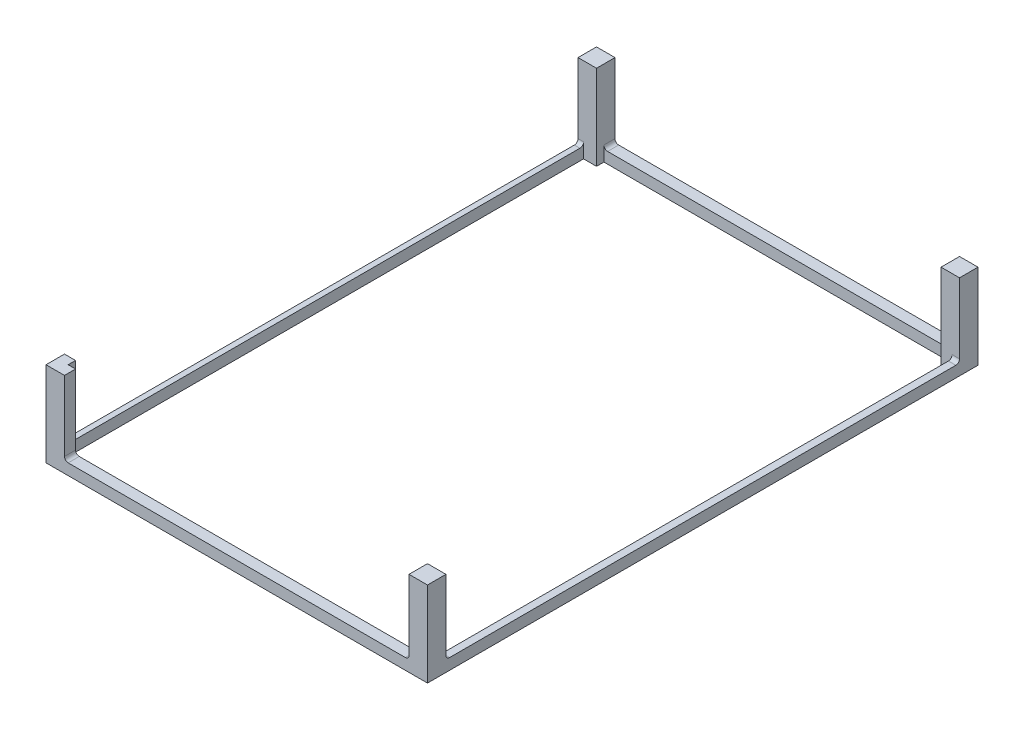
ISO-10303-21;
HEADER;
FILE_DESCRIPTION(('STEP AP214'),'2;1');
FILE_NAME('part.step','',(''),(''),'','','');
FILE_SCHEMA(('AUTOMOTIVE_DESIGN { 1 0 10303 214 1 1 1 1 }'));
ENDSEC;
DATA;
#1=APPLICATION_CONTEXT('core data for automotive mechanical design processes');
#2=APPLICATION_PROTOCOL_DEFINITION('international standard','automotive_design',2000,#1);
#3=PRODUCT_CONTEXT('',#1,'mechanical');
#4=PRODUCT('Part','Part','',(#3));
#5=PRODUCT_RELATED_PRODUCT_CATEGORY('part','',(#4));
#6=PRODUCT_DEFINITION_FORMATION('','',#4);
#7=PRODUCT_DEFINITION_CONTEXT('part definition',#1,'design');
#8=PRODUCT_DEFINITION('design','',#6,#7);
#9=PRODUCT_DEFINITION_SHAPE('','',#8);
#10=(LENGTH_UNIT() NAMED_UNIT(*) SI_UNIT(.MILLI.,.METRE.));
#11=(NAMED_UNIT(*) PLANE_ANGLE_UNIT() SI_UNIT($,.RADIAN.));
#12=(NAMED_UNIT(*) SI_UNIT($,.STERADIAN.) SOLID_ANGLE_UNIT());
#13=UNCERTAINTY_MEASURE_WITH_UNIT(LENGTH_MEASURE(1.E-05),#10,'distance_accuracy_value','');
#14=(GEOMETRIC_REPRESENTATION_CONTEXT(3) GLOBAL_UNCERTAINTY_ASSIGNED_CONTEXT((#13)) GLOBAL_UNIT_ASSIGNED_CONTEXT((#10,
#11,#12)) REPRESENTATION_CONTEXT('',''));
#15=CARTESIAN_POINT('',(0.,0.,0.));
#16=DIRECTION('',(0.,0.,1.));
#17=DIRECTION('',(1.,0.,0.));
#18=AXIS2_PLACEMENT_3D('',#15,#16,#17);
#19=CARTESIAN_POINT('',(0.,3.,0.));
#20=DIRECTION('',(0.,-1.,0.));
#21=DIRECTION('',(0.,0.,-1.));
#22=AXIS2_PLACEMENT_3D('',#19,#20,#21);
#23=PLANE('',#22);
#24=DIRECTION('',(1.,0.,0.));
#25=VECTOR('',#24,1.);
#26=CARTESIAN_POINT('',(5.,3.,-3.));
#27=LINE('',#26,#25);
#28=CARTESIAN_POINT('',(6.,3.,-3.));
#29=VERTEX_POINT('',#28);
#30=CARTESIAN_POINT('',(97.25,3.,-3.00000000000002));
#31=VERTEX_POINT('',#30);
#32=EDGE_CURVE('E363',#29,#31,#27,.T.);
#33=ORIENTED_EDGE('',*,*,#32,.F.);
#34=DIRECTION('',(0.,0.,-1.));
#35=VECTOR('',#34,1.);
#36=CARTESIAN_POINT('',(6.,3.,0.));
#37=LINE('',#36,#35);
#38=CARTESIAN_POINT('',(6.00000000000003,3.,0.));
#39=VERTEX_POINT('',#38);
#40=EDGE_CURVE('E514',#29,#39,#37,.F.);
#41=ORIENTED_EDGE('',*,*,#40,.T.);
#42=DIRECTION('',(1.,0.,0.));
#43=VECTOR('',#42,1.);
#44=CARTESIAN_POINT('',(103.25,3.,0.));
#45=LINE('',#44,#43);
#46=CARTESIAN_POINT('',(97.25,3.,0.));
#47=VERTEX_POINT('',#46);
#48=EDGE_CURVE('E464',#39,#47,#45,.T.);
#49=ORIENTED_EDGE('',*,*,#48,.T.);
#50=DIRECTION('',(0.,0.,1.));
#51=VECTOR('',#50,1.);
#52=CARTESIAN_POINT('',(97.25,3.,0.));
#53=LINE('',#52,#51);
#54=EDGE_CURVE('E511',#47,#31,#53,.F.);
#55=ORIENTED_EDGE('',*,*,#54,.T.);
#56=EDGE_LOOP('',(#33,#41,#49,#55));
#57=FACE_BOUND('',#56,.T.);
#58=ADVANCED_FACE('F45',(#57),#23,.F.);
#59=DIRECTION('',(0.,0.,1.));
#60=VECTOR('',#59,1.);
#61=CARTESIAN_POINT('',(0.,3.,0.));
#62=LINE('',#61,#60);
#63=CARTESIAN_POINT('',(0.,3.,-143.));
#64=VERTEX_POINT('',#63);
#65=CARTESIAN_POINT('',(0.,3.,-6.));
#66=VERTEX_POINT('',#65);
#67=EDGE_CURVE('E477',#64,#66,#62,.T.);
#68=ORIENTED_EDGE('',*,*,#67,.T.);
#69=DIRECTION('',(-1.,0.,0.));
#70=VECTOR('',#69,1.);
#71=CARTESIAN_POINT('',(0.,3.,-6.));
#72=LINE('',#71,#70);
#73=CARTESIAN_POINT('',(1.5,3.,-6.00000000000001));
#74=VERTEX_POINT('',#73);
#75=EDGE_CURVE('E522',#66,#74,#72,.F.);
#76=ORIENTED_EDGE('',*,*,#75,.T.);
#77=DIRECTION('',(0.,0.,1.));
#78=VECTOR('',#77,1.);
#79=CARTESIAN_POINT('',(1.5,3.,-144.));
#80=LINE('',#79,#78);
#81=CARTESIAN_POINT('',(1.5,3.,-143.));
#82=VERTEX_POINT('',#81);
#83=EDGE_CURVE('E376',#82,#74,#80,.T.);
#84=ORIENTED_EDGE('',*,*,#83,.F.);
#85=DIRECTION('',(1.,0.,0.));
#86=VECTOR('',#85,1.);
#87=CARTESIAN_POINT('',(0.,3.,-143.));
#88=LINE('',#87,#86);
#89=EDGE_CURVE('E519',#82,#64,#88,.F.);
#90=ORIENTED_EDGE('',*,*,#89,.T.);
#91=EDGE_LOOP('',(#68,#76,#84,#90));
#92=FACE_BOUND('',#91,.T.);
#93=ADVANCED_FACE('F614',(#92),#23,.F.);
#94=DIRECTION('',(0.,0.,-1.));
#95=VECTOR('',#94,1.);
#96=CARTESIAN_POINT('',(101.25,3.,-5.));
#97=LINE('',#96,#95);
#98=CARTESIAN_POINT('',(101.25,3.,-6.));
#99=VERTEX_POINT('',#98);
#100=CARTESIAN_POINT('',(101.25,3.,-143.));
#101=VERTEX_POINT('',#100);
#102=EDGE_CURVE('E367',#99,#101,#97,.T.);
#103=ORIENTED_EDGE('',*,*,#102,.F.);
#104=DIRECTION('',(-1.,0.,0.));
#105=VECTOR('',#104,1.);
#106=CARTESIAN_POINT('',(0.,3.,-6.));
#107=LINE('',#106,#105);
#108=CARTESIAN_POINT('',(103.25,3.,-6.));
#109=VERTEX_POINT('',#108);
#110=EDGE_CURVE('E536',#99,#109,#107,.F.);
#111=ORIENTED_EDGE('',*,*,#110,.T.);
#112=DIRECTION('',(0.,0.,-1.));
#113=VECTOR('',#112,1.);
#114=CARTESIAN_POINT('',(103.25,3.,0.));
#115=LINE('',#114,#113);
#116=CARTESIAN_POINT('',(103.25,3.,-143.));
#117=VERTEX_POINT('',#116);
#118=EDGE_CURVE('E468',#109,#117,#115,.T.);
#119=ORIENTED_EDGE('',*,*,#118,.T.);
#120=DIRECTION('',(1.,0.,0.));
#121=VECTOR('',#120,1.);
#122=CARTESIAN_POINT('',(0.,3.,-143.));
#123=LINE('',#122,#121);
#124=EDGE_CURVE('E533',#117,#101,#123,.F.);
#125=ORIENTED_EDGE('',*,*,#124,.T.);
#126=EDGE_LOOP('',(#103,#111,#119,#125));
#127=FACE_BOUND('',#126,.T.);
#128=ADVANCED_FACE('F719',(#127),#23,.F.);
#129=DIRECTION('',(-1.,0.,0.));
#130=VECTOR('',#129,1.);
#131=CARTESIAN_POINT('',(98.25,3.,-146.));
#132=LINE('',#131,#130);
#133=CARTESIAN_POINT('',(97.25,3.,-146.));
#134=VERTEX_POINT('',#133);
#135=CARTESIAN_POINT('',(6.00000000000001,3.,-146.));
#136=VERTEX_POINT('',#135);
#137=EDGE_CURVE('E372',#134,#136,#132,.T.);
#138=ORIENTED_EDGE('',*,*,#137,.F.);
#139=DIRECTION('',(0.,0.,1.));
#140=VECTOR('',#139,1.);
#141=CARTESIAN_POINT('',(97.25,3.,0.));
#142=LINE('',#141,#140);
#143=CARTESIAN_POINT('',(97.25,3.,-149.));
#144=VERTEX_POINT('',#143);
#145=EDGE_CURVE('E546',#134,#144,#142,.F.);
#146=ORIENTED_EDGE('',*,*,#145,.T.);
#147=DIRECTION('',(-1.,0.,0.));
#148=VECTOR('',#147,1.);
#149=CARTESIAN_POINT('',(103.25,3.,-149.));
#150=LINE('',#149,#148);
#151=CARTESIAN_POINT('',(6.00000000000003,3.,-149.));
#152=VERTEX_POINT('',#151);
#153=EDGE_CURVE('E473',#144,#152,#150,.T.);
#154=ORIENTED_EDGE('',*,*,#153,.T.);
#155=DIRECTION('',(0.,0.,-1.));
#156=VECTOR('',#155,1.);
#157=CARTESIAN_POINT('',(6.,3.,0.));
#158=LINE('',#157,#156);
#159=EDGE_CURVE('E543',#152,#136,#158,.F.);
#160=ORIENTED_EDGE('',*,*,#159,.T.);
#161=EDGE_LOOP('',(#138,#146,#154,#160));
#162=FACE_BOUND('',#161,.T.);
#163=ADVANCED_FACE('F693',(#162),#23,.F.);
#164=CARTESIAN_POINT('',(0.,0.,0.));
#165=DIRECTION('',(0.,-1.,0.));
#166=DIRECTION('',(0.,0.,-1.));
#167=AXIS2_PLACEMENT_3D('',#164,#165,#166);
#168=PLANE('',#167);
#169=DIRECTION('',(1.,0.,0.));
#170=VECTOR('',#169,1.);
#171=CARTESIAN_POINT('',(103.25,0.,0.));
#172=LINE('',#171,#170);
#173=CARTESIAN_POINT('',(0.,0.,0.));
#174=VERTEX_POINT('',#173);
#175=CARTESIAN_POINT('',(103.25,0.,0.));
#176=VERTEX_POINT('',#175);
#177=EDGE_CURVE('E463',#174,#176,#172,.T.);
#178=ORIENTED_EDGE('',*,*,#177,.F.);
#179=DIRECTION('',(0.,0.,1.));
#180=VECTOR('',#179,1.);
#181=CARTESIAN_POINT('',(0.,0.,0.));
#182=LINE('',#181,#180);
#183=CARTESIAN_POINT('',(0.,0.,-149.));
#184=VERTEX_POINT('',#183);
#185=EDGE_CURVE('E469',#184,#174,#182,.T.);
#186=ORIENTED_EDGE('',*,*,#185,.F.);
#187=DIRECTION('',(-1.,0.,0.));
#188=VECTOR('',#187,1.);
#189=CARTESIAN_POINT('',(0.,0.,-149.));
#190=LINE('',#189,#188);
#191=CARTESIAN_POINT('',(103.25,0.,-149.));
#192=VERTEX_POINT('',#191);
#193=EDGE_CURVE('E488',#192,#184,#190,.T.);
#194=ORIENTED_EDGE('',*,*,#193,.F.);
#195=DIRECTION('',(0.,0.,-1.));
#196=VECTOR('',#195,1.);
#197=CARTESIAN_POINT('',(103.25,0.,0.));
#198=LINE('',#197,#196);
#199=EDGE_CURVE('E484',#176,#192,#198,.T.);
#200=ORIENTED_EDGE('',*,*,#199,.F.);
#201=EDGE_LOOP('',(#178,#186,#194,#200));
#202=FACE_BOUND('',#201,.T.);
#203=DIRECTION('',(0.,0.,1.));
#204=VECTOR('',#203,1.);
#205=CARTESIAN_POINT('',(1.5,0.,-144.));
#206=LINE('',#205,#204);
#207=CARTESIAN_POINT('',(1.5,0.,-144.));
#208=VERTEX_POINT('',#207);
#209=CARTESIAN_POINT('',(1.5,0.,-5.));
#210=VERTEX_POINT('',#209);
#211=EDGE_CURVE('E368',#208,#210,#206,.T.);
#212=ORIENTED_EDGE('',*,*,#211,.T.);
#213=DIRECTION('',(1.,0.,0.));
#214=VECTOR('',#213,1.);
#215=CARTESIAN_POINT('',(3.,0.,-5.));
#216=LINE('',#215,#214);
#217=CARTESIAN_POINT('',(3.,0.,-5.));
#218=VERTEX_POINT('',#217);
#219=EDGE_CURVE('E362',#210,#218,#216,.T.);
#220=ORIENTED_EDGE('',*,*,#219,.T.);
#221=DIRECTION('',(0.,0.,1.));
#222=VECTOR('',#221,1.);
#223=CARTESIAN_POINT('',(3.,0.,-3.));
#224=LINE('',#223,#222);
#225=CARTESIAN_POINT('',(3.,0.,-3.));
#226=VERTEX_POINT('',#225);
#227=EDGE_CURVE('E384',#218,#226,#224,.T.);
#228=ORIENTED_EDGE('',*,*,#227,.T.);
#229=DIRECTION('',(1.,0.,0.));
#230=VECTOR('',#229,1.);
#231=CARTESIAN_POINT('',(5.,0.,-3.));
#232=LINE('',#231,#230);
#233=CARTESIAN_POINT('',(98.25,0.,-3.));
#234=VERTEX_POINT('',#233);
#235=EDGE_CURVE('E388',#226,#234,#232,.T.);
#236=ORIENTED_EDGE('',*,*,#235,.T.);
#237=DIRECTION('',(0.,0.,-1.));
#238=VECTOR('',#237,1.);
#239=CARTESIAN_POINT('',(98.25,0.,-3.));
#240=LINE('',#239,#238);
#241=CARTESIAN_POINT('',(98.25,0.,-5.));
#242=VERTEX_POINT('',#241);
#243=EDGE_CURVE('E392',#234,#242,#240,.T.);
#244=ORIENTED_EDGE('',*,*,#243,.T.);
#245=DIRECTION('',(1.,0.,0.));
#246=VECTOR('',#245,1.);
#247=CARTESIAN_POINT('',(98.25,0.,-5.));
#248=LINE('',#247,#246);
#249=CARTESIAN_POINT('',(101.25,0.,-5.));
#250=VERTEX_POINT('',#249);
#251=EDGE_CURVE('E396',#242,#250,#248,.T.);
#252=ORIENTED_EDGE('',*,*,#251,.T.);
#253=DIRECTION('',(0.,0.,-1.));
#254=VECTOR('',#253,1.);
#255=CARTESIAN_POINT('',(101.25,0.,-5.));
#256=LINE('',#255,#254);
#257=CARTESIAN_POINT('',(101.25,0.,-144.));
#258=VERTEX_POINT('',#257);
#259=EDGE_CURVE('E400',#250,#258,#256,.T.);
#260=ORIENTED_EDGE('',*,*,#259,.T.);
#261=DIRECTION('',(-1.,0.,0.));
#262=VECTOR('',#261,1.);
#263=CARTESIAN_POINT('',(101.25,0.,-144.));
#264=LINE('',#263,#262);
#265=CARTESIAN_POINT('',(98.25,0.,-144.));
#266=VERTEX_POINT('',#265);
#267=EDGE_CURVE('E404',#258,#266,#264,.T.);
#268=ORIENTED_EDGE('',*,*,#267,.T.);
#269=DIRECTION('',(0.,0.,-1.));
#270=VECTOR('',#269,1.);
#271=CARTESIAN_POINT('',(98.25,0.,-144.));
#272=LINE('',#271,#270);
#273=CARTESIAN_POINT('',(98.25,0.,-146.));
#274=VERTEX_POINT('',#273);
#275=EDGE_CURVE('E408',#266,#274,#272,.T.);
#276=ORIENTED_EDGE('',*,*,#275,.T.);
#277=DIRECTION('',(-1.,0.,0.));
#278=VECTOR('',#277,1.);
#279=CARTESIAN_POINT('',(98.25,0.,-146.));
#280=LINE('',#279,#278);
#281=CARTESIAN_POINT('',(5.,0.,-146.));
#282=VERTEX_POINT('',#281);
#283=EDGE_CURVE('E412',#274,#282,#280,.T.);
#284=ORIENTED_EDGE('',*,*,#283,.T.);
#285=DIRECTION('',(0.,0.,1.));
#286=VECTOR('',#285,1.);
#287=CARTESIAN_POINT('',(5.,0.,-146.));
#288=LINE('',#287,#286);
#289=CARTESIAN_POINT('',(5.,0.,-144.));
#290=VERTEX_POINT('',#289);
#291=EDGE_CURVE('E416',#282,#290,#288,.T.);
#292=ORIENTED_EDGE('',*,*,#291,.T.);
#293=DIRECTION('',(-1.,0.,0.));
#294=VECTOR('',#293,1.);
#295=CARTESIAN_POINT('',(5.,0.,-144.));
#296=LINE('',#295,#294);
#297=EDGE_CURVE('E420',#290,#208,#296,.T.);
#298=ORIENTED_EDGE('',*,*,#297,.T.);
#299=EDGE_LOOP('',(#212,#220,#228,#236,#244,#252,#260,#268,#276,#284,#292,#298));
#300=FACE_BOUND('',#299,.T.);
#301=ADVANCED_FACE('F631',(#202,#300),#168,.T.);
#302=CARTESIAN_POINT('',(103.25,3.,0.));
#303=DIRECTION('',(0.,0.,-1.));
#304=DIRECTION('',(-1.,0.,0.));
#305=AXIS2_PLACEMENT_3D('',#302,#303,#304);
#306=PLANE('',#305);
#307=ORIENTED_EDGE('',*,*,#177,.T.);
#308=DIRECTION('',(0.,-1.,0.));
#309=VECTOR('',#308,1.);
#310=CARTESIAN_POINT('',(103.25,3.,0.));
#311=LINE('',#310,#309);
#312=CARTESIAN_POINT('',(103.25,23.,0.));
#313=VERTEX_POINT('',#312);
#314=EDGE_CURVE('E503',#313,#176,#311,.T.);
#315=ORIENTED_EDGE('',*,*,#314,.F.);
#316=DIRECTION('',(1.,0.,0.));
#317=VECTOR('',#316,1.);
#318=CARTESIAN_POINT('',(98.25,23.,0.));
#319=LINE('',#318,#317);
#320=CARTESIAN_POINT('',(98.25,23.,0.));
#321=VERTEX_POINT('',#320);
#322=EDGE_CURVE('E310',#321,#313,#319,.T.);
#323=ORIENTED_EDGE('',*,*,#322,.F.);
#324=DIRECTION('',(0.,-1.,0.));
#325=VECTOR('',#324,1.);
#326=CARTESIAN_POINT('',(98.25,23.,0.));
#327=LINE('',#326,#325);
#328=CARTESIAN_POINT('',(98.25,4.,0.));
#329=VERTEX_POINT('',#328);
#330=EDGE_CURVE('E288',#321,#329,#327,.T.);
#331=ORIENTED_EDGE('',*,*,#330,.T.);
#332=CARTESIAN_POINT('',(97.25,4.,0.));
#333=DIRECTION('',(0.,0.,-1.));
#334=DIRECTION('',(-1.,0.,0.));
#335=AXIS2_PLACEMENT_3D('',#332,#333,#334);
#336=CIRCLE('',#335,1.);
#337=EDGE_CURVE('E574',#329,#47,#336,.T.);
#338=ORIENTED_EDGE('',*,*,#337,.T.);
#339=ORIENTED_EDGE('',*,*,#48,.F.);
#340=CARTESIAN_POINT('',(6.,4.,0.));
#341=DIRECTION('',(0.,0.,-1.));
#342=DIRECTION('',(-1.,0.,0.));
#343=AXIS2_PLACEMENT_3D('',#340,#341,#342);
#344=CIRCLE('',#343,1.);
#345=CARTESIAN_POINT('',(5.,4.,0.));
#346=VERTEX_POINT('',#345);
#347=EDGE_CURVE('E564',#39,#346,#344,.T.);
#348=ORIENTED_EDGE('',*,*,#347,.T.);
#349=DIRECTION('',(0.,-1.,0.));
#350=VECTOR('',#349,1.);
#351=CARTESIAN_POINT('',(5.,23.,0.));
#352=LINE('',#351,#350);
#353=CARTESIAN_POINT('',(5.,23.,0.));
#354=VERTEX_POINT('',#353);
#355=EDGE_CURVE('E642',#354,#346,#352,.T.);
#356=ORIENTED_EDGE('',*,*,#355,.F.);
#357=DIRECTION('',(1.,0.,0.));
#358=VECTOR('',#357,1.);
#359=CARTESIAN_POINT('',(0.,23.,0.));
#360=LINE('',#359,#358);
#361=CARTESIAN_POINT('',(0.,23.,0.));
#362=VERTEX_POINT('',#361);
#363=EDGE_CURVE('E289',#362,#354,#360,.T.);
#364=ORIENTED_EDGE('',*,*,#363,.F.);
#365=DIRECTION('',(0.,-1.,0.));
#366=VECTOR('',#365,1.);
#367=CARTESIAN_POINT('',(0.,3.,0.));
#368=LINE('',#367,#366);
#369=EDGE_CURVE('E285',#362,#174,#368,.T.);
#370=ORIENTED_EDGE('',*,*,#369,.T.);
#371=EDGE_LOOP('',(#307,#315,#323,#331,#338,#339,#348,#356,#364,#370));
#372=FACE_BOUND('',#371,.T.);
#373=ADVANCED_FACE('F639',(#372),#306,.F.);
#374=CARTESIAN_POINT('',(103.25,3.,0.));
#375=DIRECTION('',(-1.,0.,0.));
#376=DIRECTION('',(0.,0.,1.));
#377=AXIS2_PLACEMENT_3D('',#374,#375,#376);
#378=PLANE('',#377);
#379=ORIENTED_EDGE('',*,*,#199,.T.);
#380=DIRECTION('',(0.,-1.,0.));
#381=VECTOR('',#380,1.);
#382=CARTESIAN_POINT('',(103.25,3.,-149.));
#383=LINE('',#382,#381);
#384=CARTESIAN_POINT('',(103.25,23.,-149.));
#385=VERTEX_POINT('',#384);
#386=EDGE_CURVE('E499',#385,#192,#383,.T.);
#387=ORIENTED_EDGE('',*,*,#386,.F.);
#388=DIRECTION('',(0.,0.,-1.));
#389=VECTOR('',#388,1.);
#390=CARTESIAN_POINT('',(103.25,23.,-144.));
#391=LINE('',#390,#389);
#392=CARTESIAN_POINT('',(103.25,23.,-144.));
#393=VERTEX_POINT('',#392);
#394=EDGE_CURVE('E347',#393,#385,#391,.T.);
#395=ORIENTED_EDGE('',*,*,#394,.F.);
#396=DIRECTION('',(0.,-1.,0.));
#397=VECTOR('',#396,1.);
#398=CARTESIAN_POINT('',(103.25,23.,-144.));
#399=LINE('',#398,#397);
#400=CARTESIAN_POINT('',(103.25,4.,-144.));
#401=VERTEX_POINT('',#400);
#402=EDGE_CURVE('E358',#393,#401,#399,.T.);
#403=ORIENTED_EDGE('',*,*,#402,.T.);
#404=CARTESIAN_POINT('',(103.25,4.,-143.));
#405=DIRECTION('',(-1.,0.,0.));
#406=DIRECTION('',(0.,0.,1.));
#407=AXIS2_PLACEMENT_3D('',#404,#405,#406);
#408=CIRCLE('',#407,1.);
#409=EDGE_CURVE('E593',#401,#117,#408,.T.);
#410=ORIENTED_EDGE('',*,*,#409,.T.);
#411=ORIENTED_EDGE('',*,*,#118,.F.);
#412=CARTESIAN_POINT('',(103.25,4.,-6.));
#413=DIRECTION('',(-1.,0.,0.));
#414=DIRECTION('',(0.,0.,1.));
#415=AXIS2_PLACEMENT_3D('',#412,#413,#414);
#416=CIRCLE('',#415,1.);
#417=CARTESIAN_POINT('',(103.25,4.,-5.));
#418=VERTEX_POINT('',#417);
#419=EDGE_CURVE('E584',#109,#418,#416,.T.);
#420=ORIENTED_EDGE('',*,*,#419,.T.);
#421=DIRECTION('',(0.,-1.,0.));
#422=VECTOR('',#421,1.);
#423=CARTESIAN_POINT('',(103.25,23.,-5.));
#424=LINE('',#423,#422);
#425=CARTESIAN_POINT('',(103.25,23.,-5.));
#426=VERTEX_POINT('',#425);
#427=EDGE_CURVE('E294',#426,#418,#424,.T.);
#428=ORIENTED_EDGE('',*,*,#427,.F.);
#429=DIRECTION('',(0.,0.,-1.));
#430=VECTOR('',#429,1.);
#431=CARTESIAN_POINT('',(103.25,23.,-5.));
#432=LINE('',#431,#430);
#433=EDGE_CURVE('E307',#313,#426,#432,.T.);
#434=ORIENTED_EDGE('',*,*,#433,.F.);
#435=ORIENTED_EDGE('',*,*,#314,.T.);
#436=EDGE_LOOP('',(#379,#387,#395,#403,#410,#411,#420,#428,#434,#435));
#437=FACE_BOUND('',#436,.T.);
#438=ADVANCED_FACE('F634',(#437),#378,.F.);
#439=CARTESIAN_POINT('',(0.,3.,-149.));
#440=DIRECTION('',(0.,0.,1.));
#441=DIRECTION('',(1.,0.,0.));
#442=AXIS2_PLACEMENT_3D('',#439,#440,#441);
#443=PLANE('',#442);
#444=ORIENTED_EDGE('',*,*,#193,.T.);
#445=DIRECTION('',(0.,-1.,0.));
#446=VECTOR('',#445,1.);
#447=CARTESIAN_POINT('',(0.,3.,-149.));
#448=LINE('',#447,#446);
#449=CARTESIAN_POINT('',(0.,23.,-149.));
#450=VERTEX_POINT('',#449);
#451=EDGE_CURVE('E495',#450,#184,#448,.T.);
#452=ORIENTED_EDGE('',*,*,#451,.F.);
#453=DIRECTION('',(-1.,0.,0.));
#454=VECTOR('',#453,1.);
#455=CARTESIAN_POINT('',(0.,23.,-149.));
#456=LINE('',#455,#454);
#457=CARTESIAN_POINT('',(5.,23.,-149.));
#458=VERTEX_POINT('',#457);
#459=EDGE_CURVE('E325',#458,#450,#456,.T.);
#460=ORIENTED_EDGE('',*,*,#459,.F.);
#461=DIRECTION('',(0.,-1.,0.));
#462=VECTOR('',#461,1.);
#463=CARTESIAN_POINT('',(5.,23.,-149.));
#464=LINE('',#463,#462);
#465=CARTESIAN_POINT('',(5.,4.,-149.));
#466=VERTEX_POINT('',#465);
#467=EDGE_CURVE('E321',#458,#466,#464,.T.);
#468=ORIENTED_EDGE('',*,*,#467,.T.);
#469=CARTESIAN_POINT('',(6.,4.,-149.));
#470=DIRECTION('',(0.,0.,1.));
#471=DIRECTION('',(1.,0.,0.));
#472=AXIS2_PLACEMENT_3D('',#469,#470,#471);
#473=CIRCLE('',#472,1.);
#474=EDGE_CURVE('E600',#466,#152,#473,.T.);
#475=ORIENTED_EDGE('',*,*,#474,.T.);
#476=ORIENTED_EDGE('',*,*,#153,.F.);
#477=CARTESIAN_POINT('',(97.25,4.,-149.));
#478=DIRECTION('',(0.,0.,1.));
#479=DIRECTION('',(1.,0.,0.));
#480=AXIS2_PLACEMENT_3D('',#477,#478,#479);
#481=CIRCLE('',#480,1.);
#482=CARTESIAN_POINT('',(98.25,4.,-149.));
#483=VERTEX_POINT('',#482);
#484=EDGE_CURVE('E590',#144,#483,#481,.T.);
#485=ORIENTED_EDGE('',*,*,#484,.T.);
#486=DIRECTION('',(0.,-1.,0.));
#487=VECTOR('',#486,1.);
#488=CARTESIAN_POINT('',(98.25,23.,-149.));
#489=LINE('',#488,#487);
#490=CARTESIAN_POINT('',(98.25,23.,-149.));
#491=VERTEX_POINT('',#490);
#492=EDGE_CURVE('E354',#491,#483,#489,.T.);
#493=ORIENTED_EDGE('',*,*,#492,.F.);
#494=DIRECTION('',(-1.,0.,0.));
#495=VECTOR('',#494,1.);
#496=CARTESIAN_POINT('',(98.25,23.,-149.));
#497=LINE('',#496,#495);
#498=EDGE_CURVE('E351',#385,#491,#497,.T.);
#499=ORIENTED_EDGE('',*,*,#498,.F.);
#500=ORIENTED_EDGE('',*,*,#386,.T.);
#501=EDGE_LOOP('',(#444,#452,#460,#468,#475,#476,#485,#493,#499,#500));
#502=FACE_BOUND('',#501,.T.);
#503=ADVANCED_FACE('F627',(#502),#443,.F.);
#504=CARTESIAN_POINT('',(0.,3.,0.));
#505=DIRECTION('',(1.,0.,0.));
#506=DIRECTION('',(0.,0.,-1.));
#507=AXIS2_PLACEMENT_3D('',#504,#505,#506);
#508=PLANE('',#507);
#509=ORIENTED_EDGE('',*,*,#185,.T.);
#510=ORIENTED_EDGE('',*,*,#369,.F.);
#511=DIRECTION('',(0.,0.,1.));
#512=VECTOR('',#511,1.);
#513=CARTESIAN_POINT('',(0.,23.,-5.));
#514=LINE('',#513,#512);
#515=CARTESIAN_POINT('',(0.,23.,-5.));
#516=VERTEX_POINT('',#515);
#517=EDGE_CURVE('E266',#516,#362,#514,.T.);
#518=ORIENTED_EDGE('',*,*,#517,.F.);
#519=DIRECTION('',(0.,-1.,0.));
#520=VECTOR('',#519,1.);
#521=CARTESIAN_POINT('',(0.,23.,-5.));
#522=LINE('',#521,#520);
#523=CARTESIAN_POINT('',(0.,4.,-5.));
#524=VERTEX_POINT('',#523);
#525=EDGE_CURVE('E273',#516,#524,#522,.T.);
#526=ORIENTED_EDGE('',*,*,#525,.T.);
#527=CARTESIAN_POINT('',(0.,4.,-6.));
#528=DIRECTION('',(1.,0.,0.));
#529=DIRECTION('',(0.,0.,-1.));
#530=AXIS2_PLACEMENT_3D('',#527,#528,#529);
#531=CIRCLE('',#530,1.);
#532=EDGE_CURVE('E567',#524,#66,#531,.T.);
#533=ORIENTED_EDGE('',*,*,#532,.T.);
#534=ORIENTED_EDGE('',*,*,#67,.F.);
#535=CARTESIAN_POINT('',(0.,4.,-143.));
#536=DIRECTION('',(1.,0.,0.));
#537=DIRECTION('',(0.,0.,-1.));
#538=AXIS2_PLACEMENT_3D('',#535,#536,#537);
#539=CIRCLE('',#538,1.);
#540=CARTESIAN_POINT('',(0.,4.,-144.));
#541=VERTEX_POINT('',#540);
#542=EDGE_CURVE('E11',#64,#541,#539,.T.);
#543=ORIENTED_EDGE('',*,*,#542,.T.);
#544=DIRECTION('',(0.,-1.,0.));
#545=VECTOR('',#544,1.);
#546=CARTESIAN_POINT('',(0.,23.,-144.));
#547=LINE('',#546,#545);
#548=CARTESIAN_POINT('',(0.,23.,-144.));
#549=VERTEX_POINT('',#548);
#550=EDGE_CURVE('E318',#549,#541,#547,.T.);
#551=ORIENTED_EDGE('',*,*,#550,.F.);
#552=DIRECTION('',(0.,0.,1.));
#553=VECTOR('',#552,1.);
#554=CARTESIAN_POINT('',(0.,23.,-149.));
#555=LINE('',#554,#553);
#556=EDGE_CURVE('E336',#450,#549,#555,.T.);
#557=ORIENTED_EDGE('',*,*,#556,.F.);
#558=ORIENTED_EDGE('',*,*,#451,.T.);
#559=EDGE_LOOP('',(#509,#510,#518,#526,#533,#534,#543,#551,#557,#558));
#560=FACE_BOUND('',#559,.T.);
#561=ADVANCED_FACE('F283',(#560),#508,.F.);
#562=CARTESIAN_POINT('',(3.,3.,-5.));
#563=DIRECTION('',(0.,0.,-1.));
#564=DIRECTION('',(-1.,0.,0.));
#565=AXIS2_PLACEMENT_3D('',#562,#563,#564);
#566=PLANE('',#565);
#567=DIRECTION('',(0.,-1.,0.));
#568=VECTOR('',#567,1.);
#569=CARTESIAN_POINT('',(1.5,3.,-5.));
#570=LINE('',#569,#568);
#571=CARTESIAN_POINT('',(1.5,4.,-5.));
#572=VERTEX_POINT('',#571);
#573=EDGE_CURVE('E380',#572,#210,#570,.T.);
#574=ORIENTED_EDGE('',*,*,#573,.F.);
#575=DIRECTION('',(-1.,0.,0.));
#576=VECTOR('',#575,1.);
#577=CARTESIAN_POINT('',(3.,4.,-5.));
#578=LINE('',#577,#576);
#579=EDGE_CURVE('E279',#572,#524,#578,.T.);
#580=ORIENTED_EDGE('',*,*,#579,.T.);
#581=ORIENTED_EDGE('',*,*,#525,.F.);
#582=DIRECTION('',(-1.,0.,0.));
#583=VECTOR('',#582,1.);
#584=CARTESIAN_POINT('',(3.,23.,-5.));
#585=LINE('',#584,#583);
#586=CARTESIAN_POINT('',(3.,23.,-5.));
#587=VERTEX_POINT('',#586);
#588=EDGE_CURVE('E262',#587,#516,#585,.T.);
#589=ORIENTED_EDGE('',*,*,#588,.F.);
#590=DIRECTION('',(0.,-1.,0.));
#591=VECTOR('',#590,1.);
#592=CARTESIAN_POINT('',(3.,3.,-5.));
#593=LINE('',#592,#591);
#594=EDGE_CURVE('E460',#587,#218,#593,.T.);
#595=ORIENTED_EDGE('',*,*,#594,.T.);
#596=ORIENTED_EDGE('',*,*,#219,.F.);
#597=EDGE_LOOP('',(#574,#580,#581,#589,#595,#596));
#598=FACE_BOUND('',#597,.T.);
#599=ADVANCED_FACE('F277',(#598),#566,.T.);
#600=CARTESIAN_POINT('',(3.,3.,-3.));
#601=DIRECTION('',(1.,0.,0.));
#602=DIRECTION('',(0.,0.,-1.));
#603=AXIS2_PLACEMENT_3D('',#600,#601,#602);
#604=PLANE('',#603);
#605=ORIENTED_EDGE('',*,*,#227,.F.);
#606=ORIENTED_EDGE('',*,*,#594,.F.);
#607=DIRECTION('',(0.,0.,-1.));
#608=VECTOR('',#607,1.);
#609=CARTESIAN_POINT('',(3.,23.,-3.));
#610=LINE('',#609,#608);
#611=CARTESIAN_POINT('',(3.,23.,-3.));
#612=VERTEX_POINT('',#611);
#613=EDGE_CURVE('E269',#612,#587,#610,.T.);
#614=ORIENTED_EDGE('',*,*,#613,.F.);
#615=DIRECTION('',(0.,-1.,0.));
#616=VECTOR('',#615,1.);
#617=CARTESIAN_POINT('',(3.,3.,-3.));
#618=LINE('',#617,#616);
#619=EDGE_CURVE('E456',#612,#226,#618,.T.);
#620=ORIENTED_EDGE('',*,*,#619,.T.);
#621=EDGE_LOOP('',(#605,#606,#614,#620));
#622=FACE_BOUND('',#621,.T.);
#623=ADVANCED_FACE('F680',(#622),#604,.T.);
#624=CARTESIAN_POINT('',(5.,3.,-3.));
#625=DIRECTION('',(0.,0.,-1.));
#626=DIRECTION('',(-1.,0.,0.));
#627=AXIS2_PLACEMENT_3D('',#624,#625,#626);
#628=PLANE('',#627);
#629=ORIENTED_EDGE('',*,*,#235,.F.);
#630=ORIENTED_EDGE('',*,*,#619,.F.);
#631=DIRECTION('',(-1.,0.,0.));
#632=VECTOR('',#631,1.);
#633=CARTESIAN_POINT('',(5.,23.,-3.));
#634=LINE('',#633,#632);
#635=CARTESIAN_POINT('',(5.,23.,-3.));
#636=VERTEX_POINT('',#635);
#637=EDGE_CURVE('E646',#636,#612,#634,.T.);
#638=ORIENTED_EDGE('',*,*,#637,.F.);
#639=DIRECTION('',(0.,-1.,0.));
#640=VECTOR('',#639,1.);
#641=CARTESIAN_POINT('',(5.,23.,-3.));
#642=LINE('',#641,#640);
#643=CARTESIAN_POINT('',(5.,4.,-3.));
#644=VERTEX_POINT('',#643);
#645=EDGE_CURVE('E281',#636,#644,#642,.T.);
#646=ORIENTED_EDGE('',*,*,#645,.T.);
#647=CARTESIAN_POINT('',(6.,4.,-3.));
#648=DIRECTION('',(0.,0.,-1.));
#649=DIRECTION('',(-1.,0.,0.));
#650=AXIS2_PLACEMENT_3D('',#647,#648,#649);
#651=CIRCLE('',#650,1.);
#652=EDGE_CURVE('E561',#644,#29,#651,.F.);
#653=ORIENTED_EDGE('',*,*,#652,.T.);
#654=ORIENTED_EDGE('',*,*,#32,.T.);
#655=CARTESIAN_POINT('',(97.25,4.,-3.));
#656=DIRECTION('',(0.,0.,-1.));
#657=DIRECTION('',(-1.,0.,0.));
#658=AXIS2_PLACEMENT_3D('',#655,#656,#657);
#659=CIRCLE('',#658,1.);
#660=CARTESIAN_POINT('',(98.25,4.,-3.));
#661=VERTEX_POINT('',#660);
#662=EDGE_CURVE('E577',#31,#661,#659,.F.);
#663=ORIENTED_EDGE('',*,*,#662,.T.);
#664=DIRECTION('',(0.,-1.,0.));
#665=VECTOR('',#664,1.);
#666=CARTESIAN_POINT('',(98.25,3.,-3.));
#667=LINE('',#666,#665);
#668=EDGE_CURVE('E453',#661,#234,#667,.T.);
#669=ORIENTED_EDGE('',*,*,#668,.T.);
#670=EDGE_LOOP('',(#629,#630,#638,#646,#653,#654,#663,#669));
#671=FACE_BOUND('',#670,.T.);
#672=ADVANCED_FACE('F655',(#671),#628,.T.);
#673=CARTESIAN_POINT('',(98.25,3.,-3.));
#674=DIRECTION('',(-1.,0.,0.));
#675=DIRECTION('',(0.,0.,1.));
#676=AXIS2_PLACEMENT_3D('',#673,#674,#675);
#677=PLANE('',#676);
#678=ORIENTED_EDGE('',*,*,#668,.F.);
#679=DIRECTION('',(0.,0.,1.));
#680=VECTOR('',#679,1.);
#681=CARTESIAN_POINT('',(98.25,4.,-3.));
#682=LINE('',#681,#680);
#683=EDGE_CURVE('E525',#661,#329,#682,.T.);
#684=ORIENTED_EDGE('',*,*,#683,.T.);
#685=ORIENTED_EDGE('',*,*,#330,.F.);
#686=DIRECTION('',(0.,0.,1.));
#687=VECTOR('',#686,1.);
#688=CARTESIAN_POINT('',(98.25,23.,-5.));
#689=LINE('',#688,#687);
#690=CARTESIAN_POINT('',(98.25,23.,-5.));
#691=VERTEX_POINT('',#690);
#692=EDGE_CURVE('E314',#691,#321,#689,.T.);
#693=ORIENTED_EDGE('',*,*,#692,.F.);
#694=DIRECTION('',(0.,-1.,0.));
#695=VECTOR('',#694,1.);
#696=CARTESIAN_POINT('',(98.25,3.,-5.));
#697=LINE('',#696,#695);
#698=EDGE_CURVE('E450',#691,#242,#697,.T.);
#699=ORIENTED_EDGE('',*,*,#698,.T.);
#700=ORIENTED_EDGE('',*,*,#243,.F.);
#701=EDGE_LOOP('',(#678,#684,#685,#693,#699,#700));
#702=FACE_BOUND('',#701,.T.);
#703=ADVANCED_FACE('F676',(#702),#677,.T.);
#704=CARTESIAN_POINT('',(98.25,3.,-5.));
#705=DIRECTION('',(0.,0.,-1.));
#706=DIRECTION('',(-1.,0.,0.));
#707=AXIS2_PLACEMENT_3D('',#704,#705,#706);
#708=PLANE('',#707);
#709=ORIENTED_EDGE('',*,*,#427,.T.);
#710=DIRECTION('',(-1.,0.,0.));
#711=VECTOR('',#710,1.);
#712=CARTESIAN_POINT('',(98.25,4.,-5.));
#713=LINE('',#712,#711);
#714=CARTESIAN_POINT('',(101.25,4.,-5.));
#715=VERTEX_POINT('',#714);
#716=EDGE_CURVE('E529',#418,#715,#713,.T.);
#717=ORIENTED_EDGE('',*,*,#716,.T.);
#718=DIRECTION('',(0.,-1.,0.));
#719=VECTOR('',#718,1.);
#720=CARTESIAN_POINT('',(101.25,3.,-5.));
#721=LINE('',#720,#719);
#722=EDGE_CURVE('E447',#715,#250,#721,.T.);
#723=ORIENTED_EDGE('',*,*,#722,.T.);
#724=ORIENTED_EDGE('',*,*,#251,.F.);
#725=ORIENTED_EDGE('',*,*,#698,.F.);
#726=DIRECTION('',(-1.,0.,0.));
#727=VECTOR('',#726,1.);
#728=CARTESIAN_POINT('',(98.25,23.,-5.));
#729=LINE('',#728,#727);
#730=EDGE_CURVE('E303',#426,#691,#729,.T.);
#731=ORIENTED_EDGE('',*,*,#730,.F.);
#732=EDGE_LOOP('',(#709,#717,#723,#724,#725,#731));
#733=FACE_BOUND('',#732,.T.);
#734=ADVANCED_FACE('F730',(#733),#708,.T.);
#735=CARTESIAN_POINT('',(101.25,3.,-5.));
#736=DIRECTION('',(-1.,0.,0.));
#737=DIRECTION('',(0.,0.,1.));
#738=AXIS2_PLACEMENT_3D('',#735,#736,#737);
#739=PLANE('',#738);
#740=ORIENTED_EDGE('',*,*,#259,.F.);
#741=ORIENTED_EDGE('',*,*,#722,.F.);
#742=CARTESIAN_POINT('',(101.25,4.,-6.));
#743=DIRECTION('',(-1.,0.,0.));
#744=DIRECTION('',(0.,0.,1.));
#745=AXIS2_PLACEMENT_3D('',#742,#743,#744);
#746=CIRCLE('',#745,1.);
#747=EDGE_CURVE('E581',#715,#99,#746,.F.);
#748=ORIENTED_EDGE('',*,*,#747,.T.);
#749=ORIENTED_EDGE('',*,*,#102,.T.);
#750=CARTESIAN_POINT('',(101.25,4.,-143.));
#751=DIRECTION('',(-1.,0.,0.));
#752=DIRECTION('',(0.,0.,1.));
#753=AXIS2_PLACEMENT_3D('',#750,#751,#752);
#754=CIRCLE('',#753,1.);
#755=CARTESIAN_POINT('',(101.25,4.,-144.));
#756=VERTEX_POINT('',#755);
#757=EDGE_CURVE('E596',#101,#756,#754,.F.);
#758=ORIENTED_EDGE('',*,*,#757,.T.);
#759=DIRECTION('',(0.,-1.,0.));
#760=VECTOR('',#759,1.);
#761=CARTESIAN_POINT('',(101.25,3.,-144.));
#762=LINE('',#761,#760);
#763=EDGE_CURVE('E444',#756,#258,#762,.T.);
#764=ORIENTED_EDGE('',*,*,#763,.T.);
#765=EDGE_LOOP('',(#740,#741,#748,#749,#758,#764));
#766=FACE_BOUND('',#765,.T.);
#767=ADVANCED_FACE('F723',(#766),#739,.T.);
#768=CARTESIAN_POINT('',(101.25,3.,-144.));
#769=DIRECTION('',(0.,0.,1.));
#770=DIRECTION('',(1.,0.,0.));
#771=AXIS2_PLACEMENT_3D('',#768,#769,#770);
#772=PLANE('',#771);
#773=ORIENTED_EDGE('',*,*,#763,.F.);
#774=DIRECTION('',(1.,0.,0.));
#775=VECTOR('',#774,1.);
#776=CARTESIAN_POINT('',(101.25,4.,-144.));
#777=LINE('',#776,#775);
#778=EDGE_CURVE('E549',#756,#401,#777,.T.);
#779=ORIENTED_EDGE('',*,*,#778,.T.);
#780=ORIENTED_EDGE('',*,*,#402,.F.);
#781=DIRECTION('',(1.,0.,0.));
#782=VECTOR('',#781,1.);
#783=CARTESIAN_POINT('',(98.25,23.,-144.));
#784=LINE('',#783,#782);
#785=CARTESIAN_POINT('',(98.25,23.,-144.));
#786=VERTEX_POINT('',#785);
#787=EDGE_CURVE('E344',#786,#393,#784,.T.);
#788=ORIENTED_EDGE('',*,*,#787,.F.);
#789=DIRECTION('',(0.,-1.,0.));
#790=VECTOR('',#789,1.);
#791=CARTESIAN_POINT('',(98.25,3.,-144.));
#792=LINE('',#791,#790);
#793=EDGE_CURVE('E441',#786,#266,#792,.T.);
#794=ORIENTED_EDGE('',*,*,#793,.T.);
#795=ORIENTED_EDGE('',*,*,#267,.F.);
#796=EDGE_LOOP('',(#773,#779,#780,#788,#794,#795));
#797=FACE_BOUND('',#796,.T.);
#798=ADVANCED_FACE('F710',(#797),#772,.T.);
#799=CARTESIAN_POINT('',(98.25,3.,-144.));
#800=DIRECTION('',(-1.,0.,0.));
#801=DIRECTION('',(0.,0.,1.));
#802=AXIS2_PLACEMENT_3D('',#799,#800,#801);
#803=PLANE('',#802);
#804=ORIENTED_EDGE('',*,*,#492,.T.);
#805=DIRECTION('',(0.,0.,1.));
#806=VECTOR('',#805,1.);
#807=CARTESIAN_POINT('',(98.25,4.,-144.));
#808=LINE('',#807,#806);
#809=CARTESIAN_POINT('',(98.25,4.,-146.));
#810=VERTEX_POINT('',#809);
#811=EDGE_CURVE('E539',#483,#810,#808,.T.);
#812=ORIENTED_EDGE('',*,*,#811,.T.);
#813=DIRECTION('',(0.,-1.,0.));
#814=VECTOR('',#813,1.);
#815=CARTESIAN_POINT('',(98.25,3.,-146.));
#816=LINE('',#815,#814);
#817=EDGE_CURVE('E438',#810,#274,#816,.T.);
#818=ORIENTED_EDGE('',*,*,#817,.T.);
#819=ORIENTED_EDGE('',*,*,#275,.F.);
#820=ORIENTED_EDGE('',*,*,#793,.F.);
#821=DIRECTION('',(0.,0.,1.));
#822=VECTOR('',#821,1.);
#823=CARTESIAN_POINT('',(98.25,23.,-144.));
#824=LINE('',#823,#822);
#825=EDGE_CURVE('E340',#491,#786,#824,.T.);
#826=ORIENTED_EDGE('',*,*,#825,.F.);
#827=EDGE_LOOP('',(#804,#812,#818,#819,#820,#826));
#828=FACE_BOUND('',#827,.T.);
#829=ADVANCED_FACE('F702',(#828),#803,.T.);
#830=CARTESIAN_POINT('',(98.25,3.,-146.));
#831=DIRECTION('',(0.,0.,1.));
#832=DIRECTION('',(1.,0.,0.));
#833=AXIS2_PLACEMENT_3D('',#830,#831,#832);
#834=PLANE('',#833);
#835=ORIENTED_EDGE('',*,*,#283,.F.);
#836=ORIENTED_EDGE('',*,*,#817,.F.);
#837=CARTESIAN_POINT('',(97.25,4.,-146.));
#838=DIRECTION('',(0.,0.,1.));
#839=DIRECTION('',(1.,0.,0.));
#840=AXIS2_PLACEMENT_3D('',#837,#838,#839);
#841=CIRCLE('',#840,1.);
#842=EDGE_CURVE('E587',#810,#134,#841,.F.);
#843=ORIENTED_EDGE('',*,*,#842,.T.);
#844=ORIENTED_EDGE('',*,*,#137,.T.);
#845=CARTESIAN_POINT('',(6.,4.,-146.));
#846=DIRECTION('',(0.,0.,1.));
#847=DIRECTION('',(1.,0.,0.));
#848=AXIS2_PLACEMENT_3D('',#845,#846,#847);
#849=CIRCLE('',#848,1.);
#850=CARTESIAN_POINT('',(5.,4.,-146.));
#851=VERTEX_POINT('',#850);
#852=EDGE_CURVE('E603',#136,#851,#849,.F.);
#853=ORIENTED_EDGE('',*,*,#852,.T.);
#854=DIRECTION('',(0.,-1.,0.));
#855=VECTOR('',#854,1.);
#856=CARTESIAN_POINT('',(5.,3.,-146.));
#857=LINE('',#856,#855);
#858=EDGE_CURVE('E435',#851,#282,#857,.T.);
#859=ORIENTED_EDGE('',*,*,#858,.T.);
#860=EDGE_LOOP('',(#835,#836,#843,#844,#853,#859));
#861=FACE_BOUND('',#860,.T.);
#862=ADVANCED_FACE('F896',(#861),#834,.T.);
#863=CARTESIAN_POINT('',(5.,3.,-146.));
#864=DIRECTION('',(1.,0.,0.));
#865=DIRECTION('',(0.,0.,-1.));
#866=AXIS2_PLACEMENT_3D('',#863,#864,#865);
#867=PLANE('',#866);
#868=ORIENTED_EDGE('',*,*,#858,.F.);
#869=DIRECTION('',(0.,0.,-1.));
#870=VECTOR('',#869,1.);
#871=CARTESIAN_POINT('',(5.,4.,-146.));
#872=LINE('',#871,#870);
#873=EDGE_CURVE('E553',#851,#466,#872,.T.);
#874=ORIENTED_EDGE('',*,*,#873,.T.);
#875=ORIENTED_EDGE('',*,*,#467,.F.);
#876=DIRECTION('',(0.,0.,-1.));
#877=VECTOR('',#876,1.);
#878=CARTESIAN_POINT('',(5.,23.,-149.));
#879=LINE('',#878,#877);
#880=CARTESIAN_POINT('',(5.,23.,-144.));
#881=VERTEX_POINT('',#880);
#882=EDGE_CURVE('E329',#881,#458,#879,.T.);
#883=ORIENTED_EDGE('',*,*,#882,.F.);
#884=DIRECTION('',(0.,-1.,0.));
#885=VECTOR('',#884,1.);
#886=CARTESIAN_POINT('',(5.,3.,-144.));
#887=LINE('',#886,#885);
#888=EDGE_CURVE('E432',#881,#290,#887,.T.);
#889=ORIENTED_EDGE('',*,*,#888,.T.);
#890=ORIENTED_EDGE('',*,*,#291,.F.);
#891=EDGE_LOOP('',(#868,#874,#875,#883,#889,#890));
#892=FACE_BOUND('',#891,.T.);
#893=ADVANCED_FACE('F683',(#892),#867,.T.);
#894=CARTESIAN_POINT('',(5.,3.,-144.));
#895=DIRECTION('',(0.,0.,1.));
#896=DIRECTION('',(1.,0.,0.));
#897=AXIS2_PLACEMENT_3D('',#894,#895,#896);
#898=PLANE('',#897);
#899=ORIENTED_EDGE('',*,*,#550,.T.);
#900=DIRECTION('',(1.,0.,0.));
#901=VECTOR('',#900,1.);
#902=CARTESIAN_POINT('',(5.,4.,-144.));
#903=LINE('',#902,#901);
#904=CARTESIAN_POINT('',(1.5,4.,-144.));
#905=VERTEX_POINT('',#904);
#906=EDGE_CURVE('E557',#541,#905,#903,.T.);
#907=ORIENTED_EDGE('',*,*,#906,.T.);
#908=DIRECTION('',(0.,-1.,0.));
#909=VECTOR('',#908,1.);
#910=CARTESIAN_POINT('',(1.5,3.,-144.));
#911=LINE('',#910,#909);
#912=EDGE_CURVE('E61',#905,#208,#911,.T.);
#913=ORIENTED_EDGE('',*,*,#912,.T.);
#914=ORIENTED_EDGE('',*,*,#297,.F.);
#915=ORIENTED_EDGE('',*,*,#888,.F.);
#916=DIRECTION('',(1.,0.,0.));
#917=VECTOR('',#916,1.);
#918=CARTESIAN_POINT('',(0.,23.,-144.));
#919=LINE('',#918,#917);
#920=EDGE_CURVE('E332',#549,#881,#919,.T.);
#921=ORIENTED_EDGE('',*,*,#920,.F.);
#922=EDGE_LOOP('',(#899,#907,#913,#914,#915,#921));
#923=FACE_BOUND('',#922,.T.);
#924=ADVANCED_FACE('F617',(#923),#898,.T.);
#925=CARTESIAN_POINT('',(1.5,3.,-144.));
#926=DIRECTION('',(1.,0.,0.));
#927=DIRECTION('',(0.,0.,-1.));
#928=AXIS2_PLACEMENT_3D('',#925,#926,#927);
#929=PLANE('',#928);
#930=ORIENTED_EDGE('',*,*,#211,.F.);
#931=ORIENTED_EDGE('',*,*,#912,.F.);
#932=CARTESIAN_POINT('',(1.5,4.,-143.));
#933=DIRECTION('',(1.,0.,0.));
#934=DIRECTION('',(0.,0.,-1.));
#935=AXIS2_PLACEMENT_3D('',#932,#933,#934);
#936=CIRCLE('',#935,1.);
#937=EDGE_CURVE('E54',#905,#82,#936,.F.);
#938=ORIENTED_EDGE('',*,*,#937,.T.);
#939=ORIENTED_EDGE('',*,*,#83,.T.);
#940=CARTESIAN_POINT('',(1.5,4.,-6.));
#941=DIRECTION('',(1.,0.,0.));
#942=DIRECTION('',(0.,0.,-1.));
#943=AXIS2_PLACEMENT_3D('',#940,#941,#942);
#944=CIRCLE('',#943,1.);
#945=EDGE_CURVE('E570',#74,#572,#944,.F.);
#946=ORIENTED_EDGE('',*,*,#945,.T.);
#947=ORIENTED_EDGE('',*,*,#573,.T.);
#948=EDGE_LOOP('',(#930,#931,#938,#939,#946,#947));
#949=FACE_BOUND('',#948,.T.);
#950=ADVANCED_FACE('F608',(#949),#929,.T.);
#951=CARTESIAN_POINT('',(0.,23.,0.));
#952=DIRECTION('',(0.,-1.,0.));
#953=DIRECTION('',(0.,0.,-1.));
#954=AXIS2_PLACEMENT_3D('',#951,#952,#953);
#955=PLANE('',#954);
#956=ORIENTED_EDGE('',*,*,#825,.T.);
#957=ORIENTED_EDGE('',*,*,#787,.T.);
#958=ORIENTED_EDGE('',*,*,#394,.T.);
#959=ORIENTED_EDGE('',*,*,#498,.T.);
#960=EDGE_LOOP('',(#956,#957,#958,#959));
#961=FACE_BOUND('',#960,.T.);
#962=ADVANCED_FACE('F706',(#961),#955,.F.);
#963=CARTESIAN_POINT('',(0.,23.,0.));
#964=DIRECTION('',(0.,1.,0.));
#965=DIRECTION('',(0.,0.,1.));
#966=AXIS2_PLACEMENT_3D('',#963,#964,#965);
#967=PLANE('',#966);
#968=ORIENTED_EDGE('',*,*,#556,.T.);
#969=ORIENTED_EDGE('',*,*,#920,.T.);
#970=ORIENTED_EDGE('',*,*,#882,.T.);
#971=ORIENTED_EDGE('',*,*,#459,.T.);
#972=EDGE_LOOP('',(#968,#969,#970,#971));
#973=FACE_BOUND('',#972,.T.);
#974=ADVANCED_FACE('F622',(#973),#967,.T.);
#975=CARTESIAN_POINT('',(0.,23.,0.));
#976=DIRECTION('',(0.,1.,0.));
#977=DIRECTION('',(0.,0.,1.));
#978=AXIS2_PLACEMENT_3D('',#975,#976,#977);
#979=PLANE('',#978);
#980=ORIENTED_EDGE('',*,*,#692,.T.);
#981=ORIENTED_EDGE('',*,*,#322,.T.);
#982=ORIENTED_EDGE('',*,*,#433,.T.);
#983=ORIENTED_EDGE('',*,*,#730,.T.);
#984=EDGE_LOOP('',(#980,#981,#982,#983));
#985=FACE_BOUND('',#984,.T.);
#986=ADVANCED_FACE('F733',(#985),#979,.T.);
#987=CARTESIAN_POINT('',(5.,23.,0.));
#988=DIRECTION('',(-1.,0.,0.));
#989=DIRECTION('',(0.,0.,1.));
#990=AXIS2_PLACEMENT_3D('',#987,#988,#989);
#991=PLANE('',#990);
#992=ORIENTED_EDGE('',*,*,#355,.T.);
#993=DIRECTION('',(0.,0.,-1.));
#994=VECTOR('',#993,1.);
#995=CARTESIAN_POINT('',(5.,4.,-3.));
#996=LINE('',#995,#994);
#997=EDGE_CURVE('E507',#346,#644,#996,.T.);
#998=ORIENTED_EDGE('',*,*,#997,.T.);
#999=ORIENTED_EDGE('',*,*,#645,.F.);
#1000=DIRECTION('',(0.,0.,-1.));
#1001=VECTOR('',#1000,1.);
#1002=CARTESIAN_POINT('',(5.,23.,0.));
#1003=LINE('',#1002,#1001);
#1004=EDGE_CURVE('E296',#354,#636,#1003,.T.);
#1005=ORIENTED_EDGE('',*,*,#1004,.F.);
#1006=EDGE_LOOP('',(#992,#998,#999,#1005));
#1007=FACE_BOUND('',#1006,.T.);
#1008=ADVANCED_FACE('F650',(#1007),#991,.F.);
#1009=CARTESIAN_POINT('',(0.,23.,0.));
#1010=DIRECTION('',(0.,1.,0.));
#1011=DIRECTION('',(0.,0.,1.));
#1012=AXIS2_PLACEMENT_3D('',#1009,#1010,#1011);
#1013=PLANE('',#1012);
#1014=ORIENTED_EDGE('',*,*,#517,.T.);
#1015=ORIENTED_EDGE('',*,*,#363,.T.);
#1016=ORIENTED_EDGE('',*,*,#1004,.T.);
#1017=ORIENTED_EDGE('',*,*,#637,.T.);
#1018=ORIENTED_EDGE('',*,*,#613,.T.);
#1019=ORIENTED_EDGE('',*,*,#588,.T.);
#1020=EDGE_LOOP('',(#1014,#1015,#1016,#1017,#1018,#1019));
#1021=FACE_BOUND('',#1020,.T.);
#1022=ADVANCED_FACE('F264',(#1021),#1013,.T.);
#1023=CARTESIAN_POINT('',(6.,4.,0.));
#1024=DIRECTION('',(0.,0.,1.));
#1025=DIRECTION('',(1.,0.,0.));
#1026=AXIS2_PLACEMENT_3D('',#1023,#1024,#1025);
#1027=CYLINDRICAL_SURFACE('',#1026,1.);
#1028=ORIENTED_EDGE('',*,*,#347,.F.);
#1029=ORIENTED_EDGE('',*,*,#40,.F.);
#1030=ORIENTED_EDGE('',*,*,#652,.F.);
#1031=ORIENTED_EDGE('',*,*,#997,.F.);
#1032=EDGE_LOOP('',(#1028,#1029,#1030,#1031));
#1033=FACE_BOUND('',#1032,.T.);
#1034=ADVANCED_FACE('F664',(#1033),#1027,.F.);
#1035=CARTESIAN_POINT('',(3.,4.,-6.));
#1036=DIRECTION('',(-1.,0.,0.));
#1037=DIRECTION('',(0.,0.,1.));
#1038=AXIS2_PLACEMENT_3D('',#1035,#1036,#1037);
#1039=CYLINDRICAL_SURFACE('',#1038,1.);
#1040=ORIENTED_EDGE('',*,*,#945,.F.);
#1041=ORIENTED_EDGE('',*,*,#75,.F.);
#1042=ORIENTED_EDGE('',*,*,#532,.F.);
#1043=ORIENTED_EDGE('',*,*,#579,.F.);
#1044=EDGE_LOOP('',(#1040,#1041,#1042,#1043));
#1045=FACE_BOUND('',#1044,.T.);
#1046=ADVANCED_FACE('F959',(#1045),#1039,.F.);
#1047=CARTESIAN_POINT('',(97.25,4.,-3.));
#1048=DIRECTION('',(0.,0.,1.));
#1049=DIRECTION('',(1.,0.,0.));
#1050=AXIS2_PLACEMENT_3D('',#1047,#1048,#1049);
#1051=CYLINDRICAL_SURFACE('',#1050,1.);
#1052=ORIENTED_EDGE('',*,*,#662,.F.);
#1053=ORIENTED_EDGE('',*,*,#54,.F.);
#1054=ORIENTED_EDGE('',*,*,#337,.F.);
#1055=ORIENTED_EDGE('',*,*,#683,.F.);
#1056=EDGE_LOOP('',(#1052,#1053,#1054,#1055));
#1057=FACE_BOUND('',#1056,.T.);
#1058=ADVANCED_FACE('F672',(#1057),#1051,.F.);
#1059=CARTESIAN_POINT('',(98.25,4.,-6.));
#1060=DIRECTION('',(-1.,0.,0.));
#1061=DIRECTION('',(0.,0.,1.));
#1062=AXIS2_PLACEMENT_3D('',#1059,#1060,#1061);
#1063=CYLINDRICAL_SURFACE('',#1062,1.);
#1064=ORIENTED_EDGE('',*,*,#419,.F.);
#1065=ORIENTED_EDGE('',*,*,#110,.F.);
#1066=ORIENTED_EDGE('',*,*,#747,.F.);
#1067=ORIENTED_EDGE('',*,*,#716,.F.);
#1068=EDGE_LOOP('',(#1064,#1065,#1066,#1067));
#1069=FACE_BOUND('',#1068,.T.);
#1070=ADVANCED_FACE('F728',(#1069),#1063,.F.);
#1071=CARTESIAN_POINT('',(97.25,4.,-144.));
#1072=DIRECTION('',(0.,0.,1.));
#1073=DIRECTION('',(1.,0.,0.));
#1074=AXIS2_PLACEMENT_3D('',#1071,#1072,#1073);
#1075=CYLINDRICAL_SURFACE('',#1074,1.);
#1076=ORIENTED_EDGE('',*,*,#484,.F.);
#1077=ORIENTED_EDGE('',*,*,#145,.F.);
#1078=ORIENTED_EDGE('',*,*,#842,.F.);
#1079=ORIENTED_EDGE('',*,*,#811,.F.);
#1080=EDGE_LOOP('',(#1076,#1077,#1078,#1079));
#1081=FACE_BOUND('',#1080,.T.);
#1082=ADVANCED_FACE('F697',(#1081),#1075,.F.);
#1083=CARTESIAN_POINT('',(101.25,4.,-143.));
#1084=DIRECTION('',(1.,0.,0.));
#1085=DIRECTION('',(0.,0.,-1.));
#1086=AXIS2_PLACEMENT_3D('',#1083,#1084,#1085);
#1087=CYLINDRICAL_SURFACE('',#1086,1.);
#1088=ORIENTED_EDGE('',*,*,#757,.F.);
#1089=ORIENTED_EDGE('',*,*,#124,.F.);
#1090=ORIENTED_EDGE('',*,*,#409,.F.);
#1091=ORIENTED_EDGE('',*,*,#778,.F.);
#1092=EDGE_LOOP('',(#1088,#1089,#1090,#1091));
#1093=FACE_BOUND('',#1092,.T.);
#1094=ADVANCED_FACE('F715',(#1093),#1087,.F.);
#1095=CARTESIAN_POINT('',(6.,4.,-146.));
#1096=DIRECTION('',(0.,0.,-1.));
#1097=DIRECTION('',(-1.,0.,0.));
#1098=AXIS2_PLACEMENT_3D('',#1095,#1096,#1097);
#1099=CYLINDRICAL_SURFACE('',#1098,1.);
#1100=ORIENTED_EDGE('',*,*,#852,.F.);
#1101=ORIENTED_EDGE('',*,*,#159,.F.);
#1102=ORIENTED_EDGE('',*,*,#474,.F.);
#1103=ORIENTED_EDGE('',*,*,#873,.F.);
#1104=EDGE_LOOP('',(#1100,#1101,#1102,#1103));
#1105=FACE_BOUND('',#1104,.T.);
#1106=ADVANCED_FACE('F687',(#1105),#1099,.F.);
#1107=CARTESIAN_POINT('',(5.,4.,-143.));
#1108=DIRECTION('',(1.,0.,0.));
#1109=DIRECTION('',(0.,0.,-1.));
#1110=AXIS2_PLACEMENT_3D('',#1107,#1108,#1109);
#1111=CYLINDRICAL_SURFACE('',#1110,1.);
#1112=ORIENTED_EDGE('',*,*,#542,.F.);
#1113=ORIENTED_EDGE('',*,*,#89,.F.);
#1114=ORIENTED_EDGE('',*,*,#937,.F.);
#1115=ORIENTED_EDGE('',*,*,#906,.F.);
#1116=EDGE_LOOP('',(#1112,#1113,#1114,#1115));
#1117=FACE_BOUND('',#1116,.T.);
#1118=ADVANCED_FACE('F47',(#1117),#1111,.F.);
#1119=CLOSED_SHELL('',(#58,#93,#128,#163,#301,#373,#438,#503,#561,#599,#623,#672,#703,#734,#767,
#798,#829,#862,#893,#924,#950,#962,#974,#986,#1008,#1022,#1034,#1046,#1058,#1070,#1082,#1094,
#1106,#1118));
#1120=MANIFOLD_SOLID_BREP('B2',#1119);
#1121=ADVANCED_BREP_SHAPE_REPRESENTATION('',(#18,#1120),#14);
#1122=SHAPE_DEFINITION_REPRESENTATION(#9,#1121);
ENDSEC;
END-ISO-10303-21;
